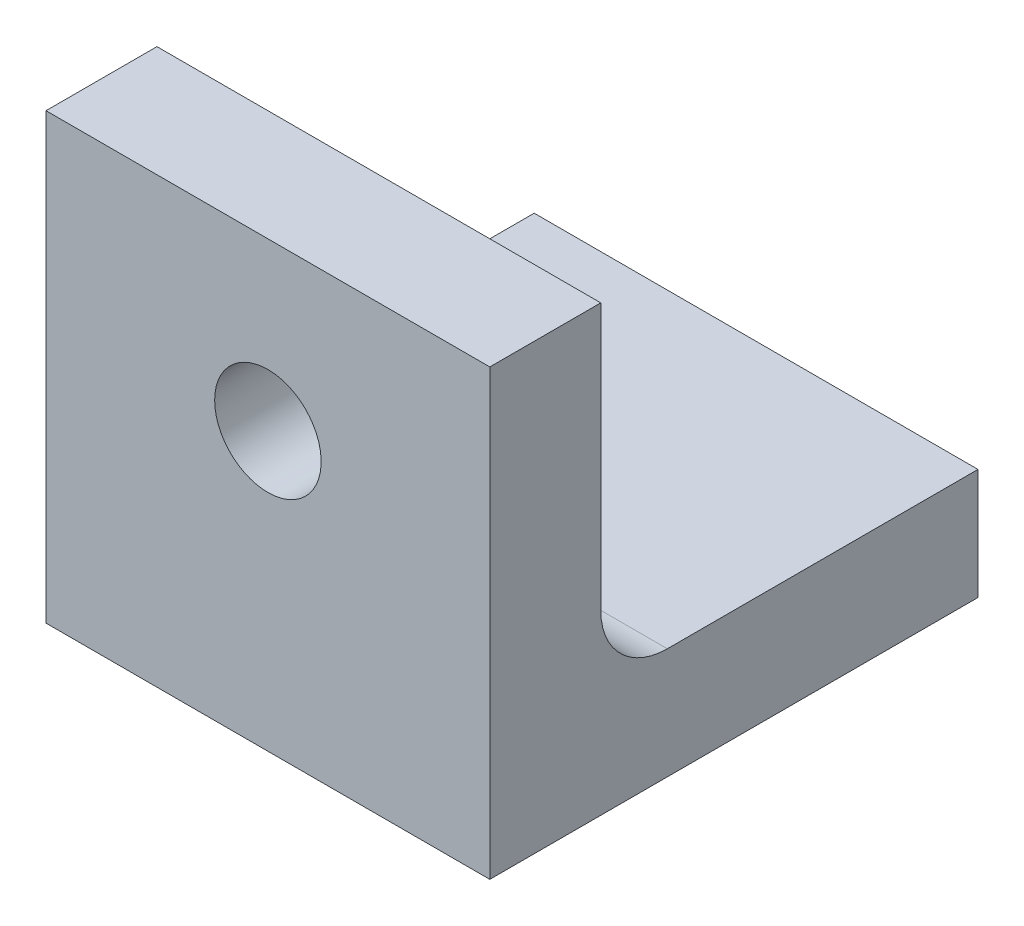
ISO-10303-21;
HEADER;
FILE_DESCRIPTION(('STEP AP214'),'2;1');
FILE_NAME('part.step','',(''),(''),'','','');
FILE_SCHEMA(('AUTOMOTIVE_DESIGN { 1 0 10303 214 1 1 1 1 }'));
ENDSEC;
DATA;
#1=APPLICATION_CONTEXT('core data for automotive mechanical design processes');
#2=APPLICATION_PROTOCOL_DEFINITION('international standard','automotive_design',2000,#1);
#3=PRODUCT_CONTEXT('',#1,'mechanical');
#4=PRODUCT('Part','Part','',(#3));
#5=PRODUCT_RELATED_PRODUCT_CATEGORY('part','',(#4));
#6=PRODUCT_DEFINITION_FORMATION('','',#4);
#7=PRODUCT_DEFINITION_CONTEXT('part definition',#1,'design');
#8=PRODUCT_DEFINITION('design','',#6,#7);
#9=PRODUCT_DEFINITION_SHAPE('','',#8);
#10=(LENGTH_UNIT() NAMED_UNIT(*) SI_UNIT(.MILLI.,.METRE.));
#11=(NAMED_UNIT(*) PLANE_ANGLE_UNIT() SI_UNIT($,.RADIAN.));
#12=(NAMED_UNIT(*) SI_UNIT($,.STERADIAN.) SOLID_ANGLE_UNIT());
#13=UNCERTAINTY_MEASURE_WITH_UNIT(LENGTH_MEASURE(1.E-05),#10,'distance_accuracy_value','');
#14=(GEOMETRIC_REPRESENTATION_CONTEXT(3) GLOBAL_UNCERTAINTY_ASSIGNED_CONTEXT((#13)) GLOBAL_UNIT_ASSIGNED_CONTEXT((#10,
#11,#12)) REPRESENTATION_CONTEXT('',''));
#15=CARTESIAN_POINT('',(0.,0.,0.));
#16=DIRECTION('',(0.,0.,1.));
#17=DIRECTION('',(1.,0.,0.));
#18=AXIS2_PLACEMENT_3D('',#15,#16,#17);
#19=CARTESIAN_POINT('',(0.,5.,0.));
#20=DIRECTION('',(0.,1.,0.));
#21=DIRECTION('',(0.,0.,1.));
#22=AXIS2_PLACEMENT_3D('',#19,#20,#21);
#23=PLANE('',#22);
#24=CARTESIAN_POINT('',(0.,5.,0.));
#25=DIRECTION('',(0.,1.,0.));
#26=DIRECTION('',(0.,0.,1.));
#27=AXIS2_PLACEMENT_3D('',#24,#25,#26);
#28=CIRCLE('',#27,2.5);
#29=CARTESIAN_POINT('',(0.,5.,2.5));
#30=VERTEX_POINT('',#29);
#31=EDGE_CURVE('E321',#30,#30,#28,.T.);
#32=ORIENTED_EDGE('',*,*,#31,.F.);
#33=EDGE_LOOP('',(#32));
#34=FACE_BOUND('',#33,.T.);
#35=DIRECTION('',(0.,0.,1.));
#36=VECTOR('',#35,1.);
#37=CARTESIAN_POINT('',(-10.,5.,0.));
#38=LINE('',#37,#36);
#39=CARTESIAN_POINT('',(-10.,5.,-11.));
#40=VERTEX_POINT('',#39);
#41=CARTESIAN_POINT('',(-10.,5.,3.));
#42=VERTEX_POINT('',#41);
#43=EDGE_CURVE('E145',#40,#42,#38,.T.);
#44=ORIENTED_EDGE('',*,*,#43,.T.);
#45=DIRECTION('',(1.,0.,0.));
#46=VECTOR('',#45,1.);
#47=CARTESIAN_POINT('',(0.,5.,3.));
#48=LINE('',#47,#46);
#49=CARTESIAN_POINT('',(10.,5.,3.));
#50=VERTEX_POINT('',#49);
#51=EDGE_CURVE('E175',#42,#50,#48,.T.);
#52=ORIENTED_EDGE('',*,*,#51,.T.);
#53=DIRECTION('',(0.,0.,1.));
#54=VECTOR('',#53,1.);
#55=CARTESIAN_POINT('',(10.,5.,0.));
#56=LINE('',#55,#54);
#57=CARTESIAN_POINT('',(10.,5.,-11.));
#58=VERTEX_POINT('',#57);
#59=EDGE_CURVE('E137',#58,#50,#56,.T.);
#60=ORIENTED_EDGE('',*,*,#59,.F.);
#61=DIRECTION('',(1.,0.,0.));
#62=VECTOR('',#61,1.);
#63=CARTESIAN_POINT('',(0.,5.,-11.));
#64=LINE('',#63,#62);
#65=EDGE_CURVE('E140',#40,#58,#64,.T.);
#66=ORIENTED_EDGE('',*,*,#65,.F.);
#67=EDGE_LOOP('',(#44,#52,#60,#66));
#68=FACE_BOUND('',#67,.T.);
#69=ADVANCED_FACE('F47',(#34,#68),#23,.T.);
#70=CARTESIAN_POINT('',(10.,5.,0.));
#71=DIRECTION('',(1.,0.,0.));
#72=DIRECTION('',(0.,0.,-1.));
#73=AXIS2_PLACEMENT_3D('',#70,#71,#72);
#74=PLANE('',#73);
#75=DIRECTION('',(0.,0.,1.));
#76=VECTOR('',#75,1.);
#77=CARTESIAN_POINT('',(10.,0.,0.));
#78=LINE('',#77,#76);
#79=CARTESIAN_POINT('',(10.,0.,-11.));
#80=VERTEX_POINT('',#79);
#81=CARTESIAN_POINT('',(10.,0.,11.));
#82=VERTEX_POINT('',#81);
#83=EDGE_CURVE('E135',#80,#82,#78,.T.);
#84=ORIENTED_EDGE('',*,*,#83,.F.);
#85=DIRECTION('',(0.,-1.,0.));
#86=VECTOR('',#85,1.);
#87=CARTESIAN_POINT('',(10.,5.,-11.));
#88=LINE('',#87,#86);
#89=EDGE_CURVE('E172',#58,#80,#88,.T.);
#90=ORIENTED_EDGE('',*,*,#89,.F.);
#91=ORIENTED_EDGE('',*,*,#59,.T.);
#92=CARTESIAN_POINT('',(10.,8.,3.));
#93=DIRECTION('',(1.,0.,0.));
#94=DIRECTION('',(0.,0.,-1.));
#95=AXIS2_PLACEMENT_3D('',#92,#93,#94);
#96=CIRCLE('',#95,3.);
#97=CARTESIAN_POINT('',(10.,8.,6.));
#98=VERTEX_POINT('',#97);
#99=EDGE_CURVE('E56',#50,#98,#96,.F.);
#100=ORIENTED_EDGE('',*,*,#99,.T.);
#101=DIRECTION('',(0.,1.,0.));
#102=VECTOR('',#101,1.);
#103=CARTESIAN_POINT('',(10.,5.,6.));
#104=LINE('',#103,#102);
#105=CARTESIAN_POINT('',(10.,20.,6.));
#106=VERTEX_POINT('',#105);
#107=EDGE_CURVE('E104',#98,#106,#104,.T.);
#108=ORIENTED_EDGE('',*,*,#107,.T.);
#109=DIRECTION('',(0.,0.,1.));
#110=VECTOR('',#109,1.);
#111=CARTESIAN_POINT('',(10.,20.,6.));
#112=LINE('',#111,#110);
#113=CARTESIAN_POINT('',(10.,20.,11.));
#114=VERTEX_POINT('',#113);
#115=EDGE_CURVE('E108',#106,#114,#112,.T.);
#116=ORIENTED_EDGE('',*,*,#115,.T.);
#117=DIRECTION('',(0.,-1.,0.));
#118=VECTOR('',#117,1.);
#119=CARTESIAN_POINT('',(10.,5.,11.));
#120=LINE('',#119,#118);
#121=EDGE_CURVE('E149',#114,#82,#120,.T.);
#122=ORIENTED_EDGE('',*,*,#121,.T.);
#123=EDGE_LOOP('',(#84,#90,#91,#100,#108,#116,#122));
#124=FACE_BOUND('',#123,.T.);
#125=ADVANCED_FACE('F107',(#124),#74,.T.);
#126=CARTESIAN_POINT('',(0.,5.,-11.));
#127=DIRECTION('',(0.,0.,-1.));
#128=DIRECTION('',(-1.,0.,0.));
#129=AXIS2_PLACEMENT_3D('',#126,#127,#128);
#130=PLANE('',#129);
#131=DIRECTION('',(1.,0.,0.));
#132=VECTOR('',#131,1.);
#133=CARTESIAN_POINT('',(0.,0.,-11.));
#134=LINE('',#133,#132);
#135=CARTESIAN_POINT('',(-10.,0.,-11.));
#136=VERTEX_POINT('',#135);
#137=EDGE_CURVE('E153',#136,#80,#134,.T.);
#138=ORIENTED_EDGE('',*,*,#137,.F.);
#139=DIRECTION('',(0.,-1.,0.));
#140=VECTOR('',#139,1.);
#141=CARTESIAN_POINT('',(-10.,5.,-11.));
#142=LINE('',#141,#140);
#143=EDGE_CURVE('E169',#40,#136,#142,.T.);
#144=ORIENTED_EDGE('',*,*,#143,.F.);
#145=ORIENTED_EDGE('',*,*,#65,.T.);
#146=ORIENTED_EDGE('',*,*,#89,.T.);
#147=EDGE_LOOP('',(#138,#144,#145,#146));
#148=FACE_BOUND('',#147,.T.);
#149=ADVANCED_FACE('F190',(#148),#130,.T.);
#150=CARTESIAN_POINT('',(-10.,5.,0.));
#151=DIRECTION('',(1.,0.,0.));
#152=DIRECTION('',(0.,0.,-1.));
#153=AXIS2_PLACEMENT_3D('',#150,#151,#152);
#154=PLANE('',#153);
#155=DIRECTION('',(0.,0.,1.));
#156=VECTOR('',#155,1.);
#157=CARTESIAN_POINT('',(-10.,0.,0.));
#158=LINE('',#157,#156);
#159=CARTESIAN_POINT('',(-10.,0.,11.));
#160=VERTEX_POINT('',#159);
#161=EDGE_CURVE('E157',#136,#160,#158,.T.);
#162=ORIENTED_EDGE('',*,*,#161,.T.);
#163=DIRECTION('',(0.,-1.,0.));
#164=VECTOR('',#163,1.);
#165=CARTESIAN_POINT('',(-10.,5.,11.));
#166=LINE('',#165,#164);
#167=CARTESIAN_POINT('',(-10.,20.,11.));
#168=VERTEX_POINT('',#167);
#169=EDGE_CURVE('E165',#168,#160,#166,.T.);
#170=ORIENTED_EDGE('',*,*,#169,.F.);
#171=DIRECTION('',(0.,0.,1.));
#172=VECTOR('',#171,1.);
#173=CARTESIAN_POINT('',(-10.,20.,6.));
#174=LINE('',#173,#172);
#175=CARTESIAN_POINT('',(-10.,20.,6.));
#176=VERTEX_POINT('',#175);
#177=EDGE_CURVE('E121',#176,#168,#174,.T.);
#178=ORIENTED_EDGE('',*,*,#177,.F.);
#179=DIRECTION('',(0.,-1.,0.));
#180=VECTOR('',#179,1.);
#181=CARTESIAN_POINT('',(-10.,5.,6.));
#182=LINE('',#181,#180);
#183=CARTESIAN_POINT('',(-10.,8.,6.));
#184=VERTEX_POINT('',#183);
#185=EDGE_CURVE('E122',#176,#184,#182,.T.);
#186=ORIENTED_EDGE('',*,*,#185,.T.);
#187=CARTESIAN_POINT('',(-10.,8.,3.));
#188=DIRECTION('',(1.,0.,0.));
#189=DIRECTION('',(0.,0.,-1.));
#190=AXIS2_PLACEMENT_3D('',#187,#188,#189);
#191=CIRCLE('',#190,3.);
#192=EDGE_CURVE('E11',#184,#42,#191,.T.);
#193=ORIENTED_EDGE('',*,*,#192,.T.);
#194=ORIENTED_EDGE('',*,*,#43,.F.);
#195=ORIENTED_EDGE('',*,*,#143,.T.);
#196=EDGE_LOOP('',(#162,#170,#178,#186,#193,#194,#195));
#197=FACE_BOUND('',#196,.T.);
#198=ADVANCED_FACE('F193',(#197),#154,.F.);
#199=CARTESIAN_POINT('',(0.,5.,11.));
#200=DIRECTION('',(0.,0.,-1.));
#201=DIRECTION('',(-1.,0.,0.));
#202=AXIS2_PLACEMENT_3D('',#199,#200,#201);
#203=PLANE('',#202);
#204=CARTESIAN_POINT('',(0.,12.5,11.));
#205=DIRECTION('',(0.,0.,-1.));
#206=DIRECTION('',(-1.,0.,0.));
#207=AXIS2_PLACEMENT_3D('',#204,#205,#206);
#208=CIRCLE('',#207,2.4);
#209=CARTESIAN_POINT('',(-2.4,12.5,11.));
#210=VERTEX_POINT('',#209);
#211=EDGE_CURVE('E317',#210,#210,#208,.T.);
#212=ORIENTED_EDGE('',*,*,#211,.T.);
#213=EDGE_LOOP('',(#212));
#214=FACE_BOUND('',#213,.T.);
#215=DIRECTION('',(1.,0.,0.));
#216=VECTOR('',#215,1.);
#217=CARTESIAN_POINT('',(0.,0.,11.));
#218=LINE('',#217,#216);
#219=EDGE_CURVE('E141',#160,#82,#218,.T.);
#220=ORIENTED_EDGE('',*,*,#219,.T.);
#221=ORIENTED_EDGE('',*,*,#121,.F.);
#222=DIRECTION('',(-1.,0.,0.));
#223=VECTOR('',#222,1.);
#224=CARTESIAN_POINT('',(10.,20.,11.));
#225=LINE('',#224,#223);
#226=EDGE_CURVE('E113',#114,#168,#225,.T.);
#227=ORIENTED_EDGE('',*,*,#226,.T.);
#228=ORIENTED_EDGE('',*,*,#169,.T.);
#229=EDGE_LOOP('',(#220,#221,#227,#228));
#230=FACE_BOUND('',#229,.T.);
#231=ADVANCED_FACE('F216',(#214,#230),#203,.F.);
#232=CARTESIAN_POINT('',(0.,0.,0.));
#233=DIRECTION('',(0.,1.,0.));
#234=DIRECTION('',(0.,0.,1.));
#235=AXIS2_PLACEMENT_3D('',#232,#233,#234);
#236=PLANE('',#235);
#237=CARTESIAN_POINT('',(0.,0.,0.));
#238=DIRECTION('',(0.,1.,0.));
#239=DIRECTION('',(0.,0.,1.));
#240=AXIS2_PLACEMENT_3D('',#237,#238,#239);
#241=CIRCLE('',#240,2.5);
#242=CARTESIAN_POINT('',(0.,0.,2.5));
#243=VERTEX_POINT('',#242);
#244=EDGE_CURVE('E133',#243,#243,#241,.T.);
#245=ORIENTED_EDGE('',*,*,#244,.T.);
#246=EDGE_LOOP('',(#245));
#247=FACE_BOUND('',#246,.T.);
#248=ORIENTED_EDGE('',*,*,#83,.T.);
#249=ORIENTED_EDGE('',*,*,#219,.F.);
#250=ORIENTED_EDGE('',*,*,#161,.F.);
#251=ORIENTED_EDGE('',*,*,#137,.T.);
#252=EDGE_LOOP('',(#248,#249,#250,#251));
#253=FACE_BOUND('',#252,.T.);
#254=ADVANCED_FACE('F213',(#247,#253),#236,.F.);
#255=CARTESIAN_POINT('',(10.,20.,6.));
#256=DIRECTION('',(0.,1.,0.));
#257=DIRECTION('',(-1.,0.,0.));
#258=AXIS2_PLACEMENT_3D('',#255,#256,#257);
#259=PLANE('',#258);
#260=ORIENTED_EDGE('',*,*,#226,.F.);
#261=ORIENTED_EDGE('',*,*,#115,.F.);
#262=DIRECTION('',(-1.,0.,0.));
#263=VECTOR('',#262,1.);
#264=CARTESIAN_POINT('',(10.,20.,6.));
#265=LINE('',#264,#263);
#266=EDGE_CURVE('E112',#106,#176,#265,.T.);
#267=ORIENTED_EDGE('',*,*,#266,.T.);
#268=ORIENTED_EDGE('',*,*,#177,.T.);
#269=EDGE_LOOP('',(#260,#261,#267,#268));
#270=FACE_BOUND('',#269,.T.);
#271=ADVANCED_FACE('F117',(#270),#259,.T.);
#272=CARTESIAN_POINT('',(0.,0.,6.));
#273=DIRECTION('',(0.,0.,1.));
#274=DIRECTION('',(1.,0.,0.));
#275=AXIS2_PLACEMENT_3D('',#272,#273,#274);
#276=PLANE('',#275);
#277=CARTESIAN_POINT('',(0.,12.5,6.));
#278=DIRECTION('',(0.,0.,-1.));
#279=DIRECTION('',(-1.,0.,0.));
#280=AXIS2_PLACEMENT_3D('',#277,#278,#279);
#281=CIRCLE('',#280,2.4);
#282=CARTESIAN_POINT('',(-2.4,12.5,6.));
#283=VERTEX_POINT('',#282);
#284=EDGE_CURVE('E314',#283,#283,#281,.T.);
#285=ORIENTED_EDGE('',*,*,#284,.F.);
#286=EDGE_LOOP('',(#285));
#287=FACE_BOUND('',#286,.T.);
#288=ORIENTED_EDGE('',*,*,#107,.F.);
#289=DIRECTION('',(1.,0.,0.));
#290=VECTOR('',#289,1.);
#291=CARTESIAN_POINT('',(0.,8.,6.));
#292=LINE('',#291,#290);
#293=EDGE_CURVE('E63',#98,#184,#292,.F.);
#294=ORIENTED_EDGE('',*,*,#293,.T.);
#295=ORIENTED_EDGE('',*,*,#185,.F.);
#296=ORIENTED_EDGE('',*,*,#266,.F.);
#297=EDGE_LOOP('',(#288,#294,#295,#296));
#298=FACE_BOUND('',#297,.T.);
#299=ADVANCED_FACE('F124',(#287,#298),#276,.F.);
#300=CARTESIAN_POINT('',(0.,5.,0.));
#301=DIRECTION('',(0.,1.,0.));
#302=DIRECTION('',(0.,0.,1.));
#303=AXIS2_PLACEMENT_3D('',#300,#301,#302);
#304=CYLINDRICAL_SURFACE('',#303,2.5);
#305=ORIENTED_EDGE('',*,*,#244,.F.);
#306=EDGE_LOOP('',(#305));
#307=FACE_BOUND('',#306,.T.);
#308=ORIENTED_EDGE('',*,*,#31,.T.);
#309=EDGE_LOOP('',(#308));
#310=FACE_BOUND('',#309,.T.);
#311=ADVANCED_FACE('F200',(#307,#310),#304,.F.);
#312=CARTESIAN_POINT('',(0.,12.5,6.));
#313=DIRECTION('',(0.,0.,-1.));
#314=DIRECTION('',(-1.,0.,0.));
#315=AXIS2_PLACEMENT_3D('',#312,#313,#314);
#316=CYLINDRICAL_SURFACE('',#315,2.4);
#317=ORIENTED_EDGE('',*,*,#211,.F.);
#318=EDGE_LOOP('',(#317));
#319=FACE_BOUND('',#318,.T.);
#320=ORIENTED_EDGE('',*,*,#284,.T.);
#321=EDGE_LOOP('',(#320));
#322=FACE_BOUND('',#321,.T.);
#323=ADVANCED_FACE('F195',(#319,#322),#316,.F.);
#324=CARTESIAN_POINT('',(0.,8.,3.));
#325=DIRECTION('',(1.,0.,0.));
#326=DIRECTION('',(0.,0.,-1.));
#327=AXIS2_PLACEMENT_3D('',#324,#325,#326);
#328=CYLINDRICAL_SURFACE('',#327,3.);
#329=ORIENTED_EDGE('',*,*,#192,.F.);
#330=ORIENTED_EDGE('',*,*,#293,.F.);
#331=ORIENTED_EDGE('',*,*,#99,.F.);
#332=ORIENTED_EDGE('',*,*,#51,.F.);
#333=EDGE_LOOP('',(#329,#330,#331,#332));
#334=FACE_BOUND('',#333,.T.);
#335=ADVANCED_FACE('F49',(#334),#328,.F.);
#336=CLOSED_SHELL('',(#69,#125,#149,#198,#231,#254,#271,#299,#311,#323,#335));
#337=MANIFOLD_SOLID_BREP('B2',#336);
#338=ADVANCED_BREP_SHAPE_REPRESENTATION('',(#18,#337),#14);
#339=SHAPE_DEFINITION_REPRESENTATION(#9,#338);
ENDSEC;
END-ISO-10303-21;
